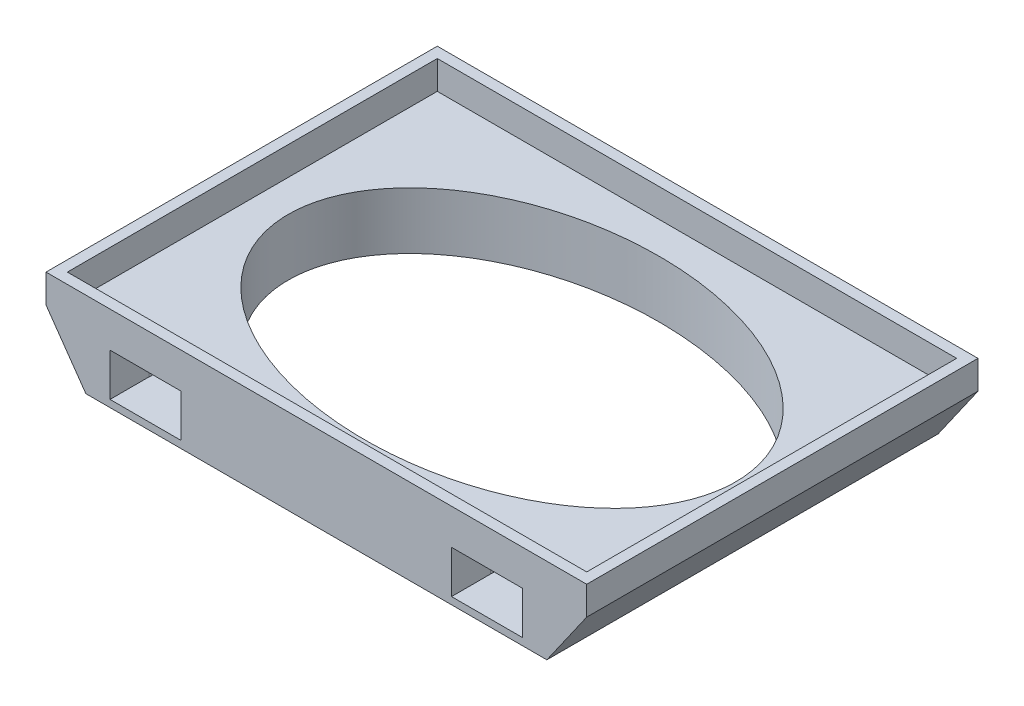
ISO-10303-21;
HEADER;
FILE_DESCRIPTION(('STEP AP214'),'2;1');
FILE_NAME('part.step','',(''),(''),'','','');
FILE_SCHEMA(('AUTOMOTIVE_DESIGN { 1 0 10303 214 1 1 1 1 }'));
ENDSEC;
DATA;
#1=APPLICATION_CONTEXT('core data for automotive mechanical design processes');
#2=APPLICATION_PROTOCOL_DEFINITION('international standard','automotive_design',2000,#1);
#3=PRODUCT_CONTEXT('',#1,'mechanical');
#4=PRODUCT('Part','Part','',(#3));
#5=PRODUCT_RELATED_PRODUCT_CATEGORY('part','',(#4));
#6=PRODUCT_DEFINITION_FORMATION('','',#4);
#7=PRODUCT_DEFINITION_CONTEXT('part definition',#1,'design');
#8=PRODUCT_DEFINITION('design','',#6,#7);
#9=PRODUCT_DEFINITION_SHAPE('','',#8);
#10=(LENGTH_UNIT() NAMED_UNIT(*) SI_UNIT(.MILLI.,.METRE.));
#11=(NAMED_UNIT(*) PLANE_ANGLE_UNIT() SI_UNIT($,.RADIAN.));
#12=(NAMED_UNIT(*) SI_UNIT($,.STERADIAN.) SOLID_ANGLE_UNIT());
#13=UNCERTAINTY_MEASURE_WITH_UNIT(LENGTH_MEASURE(1.E-05),#10,'distance_accuracy_value','');
#14=(GEOMETRIC_REPRESENTATION_CONTEXT(3) GLOBAL_UNCERTAINTY_ASSIGNED_CONTEXT((#13)) GLOBAL_UNIT_ASSIGNED_CONTEXT((#10,
#11,#12)) REPRESENTATION_CONTEXT('',''));
#15=CARTESIAN_POINT('',(0.,0.,0.));
#16=DIRECTION('',(0.,0.,1.));
#17=DIRECTION('',(1.,0.,0.));
#18=AXIS2_PLACEMENT_3D('',#15,#16,#17);
#19=CARTESIAN_POINT('',(-19.,-6.,-13.75));
#20=DIRECTION('',(0.,0.,-1.));
#21=DIRECTION('',(-1.,0.,0.));
#22=AXIS2_PLACEMENT_3D('',#19,#20,#21);
#23=PLANE('',#22);
#24=DIRECTION('',(-0.573576436351042,0.819152044288995,0.));
#25=VECTOR('',#24,1.);
#26=CARTESIAN_POINT('',(-19.,-2.,-13.75));
#27=LINE('',#26,#25);
#28=CARTESIAN_POINT('',(-16.1991698471612,-6.,-13.75));
#29=VERTEX_POINT('',#28);
#30=CARTESIAN_POINT('',(-19.,-2.,-13.75));
#31=VERTEX_POINT('',#30);
#32=EDGE_CURVE('E55',#29,#31,#27,.T.);
#33=ORIENTED_EDGE('',*,*,#32,.T.);
#34=DIRECTION('',(0.,1.,0.));
#35=VECTOR('',#34,1.);
#36=CARTESIAN_POINT('',(-19.,-6.,-13.75));
#37=LINE('',#36,#35);
#38=CARTESIAN_POINT('',(-19.,0.,-13.75));
#39=VERTEX_POINT('',#38);
#40=EDGE_CURVE('E245',#31,#39,#37,.T.);
#41=ORIENTED_EDGE('',*,*,#40,.T.);
#42=DIRECTION('',(-1.,0.,0.));
#43=VECTOR('',#42,1.);
#44=CARTESIAN_POINT('',(-19.,0.,-13.75));
#45=LINE('',#44,#43);
#46=CARTESIAN_POINT('',(19.,0.,-13.75));
#47=VERTEX_POINT('',#46);
#48=EDGE_CURVE('E226',#47,#39,#45,.T.);
#49=ORIENTED_EDGE('',*,*,#48,.F.);
#50=DIRECTION('',(0.,1.,0.));
#51=VECTOR('',#50,1.);
#52=CARTESIAN_POINT('',(19.,-6.,-13.75));
#53=LINE('',#52,#51);
#54=CARTESIAN_POINT('',(19.,-2.,-13.75));
#55=VERTEX_POINT('',#54);
#56=EDGE_CURVE('E248',#55,#47,#53,.T.);
#57=ORIENTED_EDGE('',*,*,#56,.F.);
#58=DIRECTION('',(-0.573576436351042,-0.819152044288994,0.));
#59=VECTOR('',#58,1.);
#60=CARTESIAN_POINT('',(19.,-2.,-13.75));
#61=LINE('',#60,#59);
#62=CARTESIAN_POINT('',(16.1991698471612,-6.,-13.75));
#63=VERTEX_POINT('',#62);
#64=EDGE_CURVE('E448',#55,#63,#61,.T.);
#65=ORIENTED_EDGE('',*,*,#64,.T.);
#66=DIRECTION('',(-1.,0.,0.));
#67=VECTOR('',#66,1.);
#68=CARTESIAN_POINT('',(-19.,-6.,-13.75));
#69=LINE('',#68,#67);
#70=EDGE_CURVE('E225',#63,#29,#69,.T.);
#71=ORIENTED_EDGE('',*,*,#70,.T.);
#72=EDGE_LOOP('',(#33,#41,#49,#57,#65,#71));
#73=FACE_BOUND('',#72,.T.);
#74=DIRECTION('',(1.,0.,0.));
#75=VECTOR('',#74,1.);
#76=CARTESIAN_POINT('',(-19.,-2.5,-13.75));
#77=LINE('',#76,#75);
#78=CARTESIAN_POINT('',(-14.5,-2.5,-13.75));
#79=VERTEX_POINT('',#78);
#80=CARTESIAN_POINT('',(-9.5,-2.5,-13.75));
#81=VERTEX_POINT('',#80);
#82=EDGE_CURVE('E11',#79,#81,#77,.T.);
#83=ORIENTED_EDGE('',*,*,#82,.F.);
#84=DIRECTION('',(0.,1.,0.));
#85=VECTOR('',#84,1.);
#86=CARTESIAN_POINT('',(-14.5,-6.,-13.75));
#87=LINE('',#86,#85);
#88=CARTESIAN_POINT('',(-14.5,-5.5,-13.75));
#89=VERTEX_POINT('',#88);
#90=EDGE_CURVE('E290',#89,#79,#87,.T.);
#91=ORIENTED_EDGE('',*,*,#90,.F.);
#92=DIRECTION('',(1.,0.,0.));
#93=VECTOR('',#92,1.);
#94=CARTESIAN_POINT('',(-19.,-5.5,-13.75));
#95=LINE('',#94,#93);
#96=CARTESIAN_POINT('',(-9.49999999999996,-5.5,-13.75));
#97=VERTEX_POINT('',#96);
#98=EDGE_CURVE('E287',#89,#97,#95,.T.);
#99=ORIENTED_EDGE('',*,*,#98,.T.);
#100=DIRECTION('',(0.,-1.,0.));
#101=VECTOR('',#100,1.);
#102=CARTESIAN_POINT('',(-9.5,-6.,-13.75));
#103=LINE('',#102,#101);
#104=EDGE_CURVE('E40',#81,#97,#103,.T.);
#105=ORIENTED_EDGE('',*,*,#104,.F.);
#106=EDGE_LOOP('',(#83,#91,#99,#105));
#107=FACE_BOUND('',#106,.T.);
#108=DIRECTION('',(0.,-1.,0.));
#109=VECTOR('',#108,1.);
#110=CARTESIAN_POINT('',(14.5,-6.,-13.75));
#111=LINE('',#110,#109);
#112=CARTESIAN_POINT('',(14.5,-2.5,-13.75));
#113=VERTEX_POINT('',#112);
#114=CARTESIAN_POINT('',(14.5,-5.5,-13.75));
#115=VERTEX_POINT('',#114);
#116=EDGE_CURVE('E281',#113,#115,#111,.T.);
#117=ORIENTED_EDGE('',*,*,#116,.F.);
#118=DIRECTION('',(-1.,0.,0.));
#119=VECTOR('',#118,1.);
#120=CARTESIAN_POINT('',(-19.,-2.5,-13.75));
#121=LINE('',#120,#119);
#122=CARTESIAN_POINT('',(9.49999999999999,-2.5,-13.75));
#123=VERTEX_POINT('',#122);
#124=EDGE_CURVE('E284',#113,#123,#121,.T.);
#125=ORIENTED_EDGE('',*,*,#124,.T.);
#126=DIRECTION('',(0.,1.,0.));
#127=VECTOR('',#126,1.);
#128=CARTESIAN_POINT('',(9.49999999999999,-6.,-13.75));
#129=LINE('',#128,#127);
#130=CARTESIAN_POINT('',(9.49999999999999,-5.5,-13.75));
#131=VERTEX_POINT('',#130);
#132=EDGE_CURVE('E279',#131,#123,#129,.T.);
#133=ORIENTED_EDGE('',*,*,#132,.F.);
#134=DIRECTION('',(-1.,0.,0.));
#135=VECTOR('',#134,1.);
#136=CARTESIAN_POINT('',(-19.,-5.5,-13.75));
#137=LINE('',#136,#135);
#138=EDGE_CURVE('E277',#115,#131,#137,.T.);
#139=ORIENTED_EDGE('',*,*,#138,.F.);
#140=EDGE_LOOP('',(#117,#125,#133,#139));
#141=FACE_BOUND('',#140,.T.);
#142=ADVANCED_FACE('F32',(#73,#107,#141),#23,.T.);
#143=CARTESIAN_POINT('',(-19.,-6.,13.75));
#144=DIRECTION('',(0.,0.,1.));
#145=DIRECTION('',(1.,0.,0.));
#146=AXIS2_PLACEMENT_3D('',#143,#144,#145);
#147=PLANE('',#146);
#148=DIRECTION('',(-0.573576436351042,0.819152044288995,0.));
#149=VECTOR('',#148,1.);
#150=CARTESIAN_POINT('',(-19.,-2.,13.75));
#151=LINE('',#150,#149);
#152=CARTESIAN_POINT('',(-16.1991698471612,-6.,13.75));
#153=VERTEX_POINT('',#152);
#154=CARTESIAN_POINT('',(-19.,-2.,13.75));
#155=VERTEX_POINT('',#154);
#156=EDGE_CURVE('E204',#153,#155,#151,.T.);
#157=ORIENTED_EDGE('',*,*,#156,.F.);
#158=DIRECTION('',(1.,0.,0.));
#159=VECTOR('',#158,1.);
#160=CARTESIAN_POINT('',(-19.,-6.,13.75));
#161=LINE('',#160,#159);
#162=CARTESIAN_POINT('',(16.1991698471612,-6.,13.75));
#163=VERTEX_POINT('',#162);
#164=EDGE_CURVE('E217',#153,#163,#161,.T.);
#165=ORIENTED_EDGE('',*,*,#164,.T.);
#166=DIRECTION('',(-0.573576436351042,-0.819152044288994,0.));
#167=VECTOR('',#166,1.);
#168=CARTESIAN_POINT('',(19.,-2.,13.75));
#169=LINE('',#168,#167);
#170=CARTESIAN_POINT('',(19.,-2.,13.75));
#171=VERTEX_POINT('',#170);
#172=EDGE_CURVE('E47',#171,#163,#169,.T.);
#173=ORIENTED_EDGE('',*,*,#172,.F.);
#174=DIRECTION('',(0.,1.,0.));
#175=VECTOR('',#174,1.);
#176=CARTESIAN_POINT('',(19.,-6.,13.75));
#177=LINE('',#176,#175);
#178=CARTESIAN_POINT('',(19.,0.,13.75));
#179=VERTEX_POINT('',#178);
#180=EDGE_CURVE('E250',#171,#179,#177,.T.);
#181=ORIENTED_EDGE('',*,*,#180,.T.);
#182=DIRECTION('',(1.,0.,0.));
#183=VECTOR('',#182,1.);
#184=CARTESIAN_POINT('',(-19.,0.,13.75));
#185=LINE('',#184,#183);
#186=CARTESIAN_POINT('',(-19.,0.,13.75));
#187=VERTEX_POINT('',#186);
#188=EDGE_CURVE('E239',#187,#179,#185,.T.);
#189=ORIENTED_EDGE('',*,*,#188,.F.);
#190=DIRECTION('',(0.,1.,0.));
#191=VECTOR('',#190,1.);
#192=CARTESIAN_POINT('',(-19.,-6.,13.75));
#193=LINE('',#192,#191);
#194=EDGE_CURVE('E219',#155,#187,#193,.T.);
#195=ORIENTED_EDGE('',*,*,#194,.F.);
#196=EDGE_LOOP('',(#157,#165,#173,#181,#189,#195));
#197=FACE_BOUND('',#196,.T.);
#198=DIRECTION('',(-1.,0.,0.));
#199=VECTOR('',#198,1.);
#200=CARTESIAN_POINT('',(-19.,-2.5,13.75));
#201=LINE('',#200,#199);
#202=CARTESIAN_POINT('',(14.5,-2.5,13.75));
#203=VERTEX_POINT('',#202);
#204=CARTESIAN_POINT('',(9.49999999999999,-2.5,13.75));
#205=VERTEX_POINT('',#204);
#206=EDGE_CURVE('E275',#203,#205,#201,.T.);
#207=ORIENTED_EDGE('',*,*,#206,.F.);
#208=DIRECTION('',(0.,1.,0.));
#209=VECTOR('',#208,1.);
#210=CARTESIAN_POINT('',(14.5,-6.,13.75));
#211=LINE('',#210,#209);
#212=CARTESIAN_POINT('',(14.5,-5.5,13.75));
#213=VERTEX_POINT('',#212);
#214=EDGE_CURVE('E270',#213,#203,#211,.T.);
#215=ORIENTED_EDGE('',*,*,#214,.F.);
#216=DIRECTION('',(-1.,0.,0.));
#217=VECTOR('',#216,1.);
#218=CARTESIAN_POINT('',(-19.,-5.5,13.75));
#219=LINE('',#218,#217);
#220=CARTESIAN_POINT('',(9.49999999999995,-5.5,13.75));
#221=VERTEX_POINT('',#220);
#222=EDGE_CURVE('E267',#213,#221,#219,.T.);
#223=ORIENTED_EDGE('',*,*,#222,.T.);
#224=DIRECTION('',(0.,-1.,0.));
#225=VECTOR('',#224,1.);
#226=CARTESIAN_POINT('',(9.49999999999999,-6.,13.75));
#227=LINE('',#226,#225);
#228=EDGE_CURVE('E272',#205,#221,#227,.T.);
#229=ORIENTED_EDGE('',*,*,#228,.F.);
#230=EDGE_LOOP('',(#207,#215,#223,#229));
#231=FACE_BOUND('',#230,.T.);
#232=DIRECTION('',(0.,-1.,0.));
#233=VECTOR('',#232,1.);
#234=CARTESIAN_POINT('',(-14.5,-6.,13.75));
#235=LINE('',#234,#233);
#236=CARTESIAN_POINT('',(-14.5,-2.5,13.75));
#237=VERTEX_POINT('',#236);
#238=CARTESIAN_POINT('',(-14.5,-5.5,13.75));
#239=VERTEX_POINT('',#238);
#240=EDGE_CURVE('E261',#237,#239,#235,.T.);
#241=ORIENTED_EDGE('',*,*,#240,.F.);
#242=DIRECTION('',(1.,0.,0.));
#243=VECTOR('',#242,1.);
#244=CARTESIAN_POINT('',(-19.,-2.5,13.75));
#245=LINE('',#244,#243);
#246=CARTESIAN_POINT('',(-9.5,-2.5,13.75));
#247=VERTEX_POINT('',#246);
#248=EDGE_CURVE('E264',#237,#247,#245,.T.);
#249=ORIENTED_EDGE('',*,*,#248,.T.);
#250=DIRECTION('',(0.,1.,0.));
#251=VECTOR('',#250,1.);
#252=CARTESIAN_POINT('',(-9.5,-6.,13.75));
#253=LINE('',#252,#251);
#254=CARTESIAN_POINT('',(-9.5,-5.5,13.75));
#255=VERTEX_POINT('',#254);
#256=EDGE_CURVE('E259',#255,#247,#253,.T.);
#257=ORIENTED_EDGE('',*,*,#256,.F.);
#258=DIRECTION('',(1.,0.,0.));
#259=VECTOR('',#258,1.);
#260=CARTESIAN_POINT('',(-19.,-5.5,13.75));
#261=LINE('',#260,#259);
#262=EDGE_CURVE('E247',#239,#255,#261,.T.);
#263=ORIENTED_EDGE('',*,*,#262,.F.);
#264=EDGE_LOOP('',(#241,#249,#257,#263));
#265=FACE_BOUND('',#264,.T.);
#266=ADVANCED_FACE('F215',(#197,#231,#265),#147,.T.);
#267=CARTESIAN_POINT('',(-19.,-6.,13.75));
#268=DIRECTION('',(-1.,0.,0.));
#269=DIRECTION('',(0.,0.,1.));
#270=AXIS2_PLACEMENT_3D('',#267,#268,#269);
#271=PLANE('',#270);
#272=DIRECTION('',(0.,0.,1.));
#273=VECTOR('',#272,1.);
#274=CARTESIAN_POINT('',(-19.,-2.,-13.75));
#275=LINE('',#274,#273);
#276=EDGE_CURVE('E210',#31,#155,#275,.T.);
#277=ORIENTED_EDGE('',*,*,#276,.T.);
#278=ORIENTED_EDGE('',*,*,#194,.T.);
#279=DIRECTION('',(0.,0.,1.));
#280=VECTOR('',#279,1.);
#281=CARTESIAN_POINT('',(-19.,0.,13.75));
#282=LINE('',#281,#280);
#283=EDGE_CURVE('E236',#39,#187,#282,.T.);
#284=ORIENTED_EDGE('',*,*,#283,.F.);
#285=ORIENTED_EDGE('',*,*,#40,.F.);
#286=EDGE_LOOP('',(#277,#278,#284,#285));
#287=FACE_BOUND('',#286,.T.);
#288=ADVANCED_FACE('F34',(#287),#271,.T.);
#289=CARTESIAN_POINT('',(19.,-6.,13.75));
#290=DIRECTION('',(1.,0.,0.));
#291=DIRECTION('',(0.,0.,-1.));
#292=AXIS2_PLACEMENT_3D('',#289,#290,#291);
#293=PLANE('',#292);
#294=DIRECTION('',(0.,0.,1.));
#295=VECTOR('',#294,1.);
#296=CARTESIAN_POINT('',(19.,-2.,-13.75));
#297=LINE('',#296,#295);
#298=EDGE_CURVE('E220',#55,#171,#297,.T.);
#299=ORIENTED_EDGE('',*,*,#298,.F.);
#300=ORIENTED_EDGE('',*,*,#56,.T.);
#301=DIRECTION('',(0.,0.,-1.));
#302=VECTOR('',#301,1.);
#303=CARTESIAN_POINT('',(19.,0.,13.75));
#304=LINE('',#303,#302);
#305=EDGE_CURVE('E230',#179,#47,#304,.T.);
#306=ORIENTED_EDGE('',*,*,#305,.F.);
#307=ORIENTED_EDGE('',*,*,#180,.F.);
#308=EDGE_LOOP('',(#299,#300,#306,#307));
#309=FACE_BOUND('',#308,.T.);
#310=ADVANCED_FACE('F426',(#309),#293,.T.);
#311=CARTESIAN_POINT('',(0.,-6.,0.));
#312=DIRECTION('',(0.,-1.,0.));
#313=DIRECTION('',(0.,0.,-1.));
#314=AXIS2_PLACEMENT_3D('',#311,#312,#313);
#315=PLANE('',#314);
#316=DIRECTION('',(0.,0.,1.));
#317=VECTOR('',#316,1.);
#318=CARTESIAN_POINT('',(-16.1991698471612,-6.,-13.75));
#319=LINE('',#318,#317);
#320=EDGE_CURVE('E201',#29,#153,#319,.T.);
#321=ORIENTED_EDGE('',*,*,#320,.F.);
#322=ORIENTED_EDGE('',*,*,#70,.F.);
#323=DIRECTION('',(0.,0.,1.));
#324=VECTOR('',#323,1.);
#325=CARTESIAN_POINT('',(16.1991698471612,-6.,-13.75));
#326=LINE('',#325,#324);
#327=EDGE_CURVE('E224',#63,#163,#326,.T.);
#328=ORIENTED_EDGE('',*,*,#327,.T.);
#329=ORIENTED_EDGE('',*,*,#164,.F.);
#330=EDGE_LOOP('',(#321,#322,#328,#329));
#331=FACE_BOUND('',#330,.T.);
#332=CARTESIAN_POINT('',(0.,-6.,0.));
#333=DIRECTION('',(0.,1.,0.));
#334=DIRECTION('',(0.999515945982097,0.,0.0311106690303014));
#335=AXIS2_PLACEMENT_3D('',#332,#333,#334);
#336=ELLIPSE('',#335,16.0077486150347,10.7552061007264);
#337=CARTESIAN_POINT('',(16.,-6.,0.49801176908261));
#338=VERTEX_POINT('',#337);
#339=EDGE_CURVE('E257',#338,#338,#336,.T.);
#340=ORIENTED_EDGE('',*,*,#339,.T.);
#341=EDGE_LOOP('',(#340));
#342=FACE_BOUND('',#341,.T.);
#343=ADVANCED_FACE('F222',(#331,#342),#315,.T.);
#344=CARTESIAN_POINT('',(0.,0.,0.));
#345=DIRECTION('',(0.,-1.,0.));
#346=DIRECTION('',(0.,0.,-1.));
#347=AXIS2_PLACEMENT_3D('',#344,#345,#346);
#348=PLANE('',#347);
#349=DIRECTION('',(1.,0.,0.));
#350=VECTOR('',#349,1.);
#351=CARTESIAN_POINT('',(-18.25,0.,13.));
#352=LINE('',#351,#350);
#353=CARTESIAN_POINT('',(-18.25,0.,13.));
#354=VERTEX_POINT('',#353);
#355=CARTESIAN_POINT('',(18.25,0.,13.));
#356=VERTEX_POINT('',#355);
#357=EDGE_CURVE('E770',#354,#356,#352,.T.);
#358=ORIENTED_EDGE('',*,*,#357,.F.);
#359=DIRECTION('',(0.,0.,1.));
#360=VECTOR('',#359,1.);
#361=CARTESIAN_POINT('',(-18.25,0.,-13.));
#362=LINE('',#361,#360);
#363=CARTESIAN_POINT('',(-18.25,0.,-13.));
#364=VERTEX_POINT('',#363);
#365=EDGE_CURVE('E256',#364,#354,#362,.T.);
#366=ORIENTED_EDGE('',*,*,#365,.F.);
#367=DIRECTION('',(-1.,0.,0.));
#368=VECTOR('',#367,1.);
#369=CARTESIAN_POINT('',(-18.25,0.,-13.));
#370=LINE('',#369,#368);
#371=CARTESIAN_POINT('',(18.25,0.,-13.));
#372=VERTEX_POINT('',#371);
#373=EDGE_CURVE('E776',#372,#364,#370,.T.);
#374=ORIENTED_EDGE('',*,*,#373,.F.);
#375=DIRECTION('',(0.,0.,-1.));
#376=VECTOR('',#375,1.);
#377=CARTESIAN_POINT('',(18.25,0.,-13.));
#378=LINE('',#377,#376);
#379=EDGE_CURVE('E773',#356,#372,#378,.T.);
#380=ORIENTED_EDGE('',*,*,#379,.F.);
#381=EDGE_LOOP('',(#358,#366,#374,#380));
#382=FACE_BOUND('',#381,.T.);
#383=ORIENTED_EDGE('',*,*,#283,.T.);
#384=ORIENTED_EDGE('',*,*,#188,.T.);
#385=ORIENTED_EDGE('',*,*,#305,.T.);
#386=ORIENTED_EDGE('',*,*,#48,.T.);
#387=EDGE_LOOP('',(#383,#384,#385,#386));
#388=FACE_BOUND('',#387,.T.);
#389=ADVANCED_FACE('F422',(#382,#388),#348,.F.);
#390=CARTESIAN_POINT('',(-18.25,-2.,-13.));
#391=DIRECTION('',(-1.,0.,0.));
#392=DIRECTION('',(0.,0.,1.));
#393=AXIS2_PLACEMENT_3D('',#390,#391,#392);
#394=PLANE('',#393);
#395=ORIENTED_EDGE('',*,*,#365,.T.);
#396=DIRECTION('',(0.,1.,0.));
#397=VECTOR('',#396,1.);
#398=CARTESIAN_POINT('',(-18.25,-2.,13.));
#399=LINE('',#398,#397);
#400=CARTESIAN_POINT('',(-18.25,-2.,13.));
#401=VERTEX_POINT('',#400);
#402=EDGE_CURVE('E233',#401,#354,#399,.T.);
#403=ORIENTED_EDGE('',*,*,#402,.F.);
#404=DIRECTION('',(0.,0.,1.));
#405=VECTOR('',#404,1.);
#406=CARTESIAN_POINT('',(-18.25,-2.,-13.));
#407=LINE('',#406,#405);
#408=CARTESIAN_POINT('',(-18.25,-2.,-13.));
#409=VERTEX_POINT('',#408);
#410=EDGE_CURVE('E392',#409,#401,#407,.T.);
#411=ORIENTED_EDGE('',*,*,#410,.F.);
#412=DIRECTION('',(0.,1.,0.));
#413=VECTOR('',#412,1.);
#414=CARTESIAN_POINT('',(-18.25,-2.,-13.));
#415=LINE('',#414,#413);
#416=EDGE_CURVE('E240',#409,#364,#415,.T.);
#417=ORIENTED_EDGE('',*,*,#416,.T.);
#418=EDGE_LOOP('',(#395,#403,#411,#417));
#419=FACE_BOUND('',#418,.T.);
#420=ADVANCED_FACE('F412',(#419),#394,.F.);
#421=CARTESIAN_POINT('',(-18.25,-2.,-13.));
#422=DIRECTION('',(0.,0.,-1.));
#423=DIRECTION('',(-1.,0.,0.));
#424=AXIS2_PLACEMENT_3D('',#421,#422,#423);
#425=PLANE('',#424);
#426=ORIENTED_EDGE('',*,*,#373,.T.);
#427=ORIENTED_EDGE('',*,*,#416,.F.);
#428=DIRECTION('',(-1.,0.,0.));
#429=VECTOR('',#428,1.);
#430=CARTESIAN_POINT('',(-18.25,-2.,-13.));
#431=LINE('',#430,#429);
#432=CARTESIAN_POINT('',(18.25,-2.,-13.));
#433=VERTEX_POINT('',#432);
#434=EDGE_CURVE('E787',#433,#409,#431,.T.);
#435=ORIENTED_EDGE('',*,*,#434,.F.);
#436=DIRECTION('',(0.,1.,0.));
#437=VECTOR('',#436,1.);
#438=CARTESIAN_POINT('',(18.25,-2.,-13.));
#439=LINE('',#438,#437);
#440=EDGE_CURVE('E784',#433,#372,#439,.T.);
#441=ORIENTED_EDGE('',*,*,#440,.T.);
#442=EDGE_LOOP('',(#426,#427,#435,#441));
#443=FACE_BOUND('',#442,.T.);
#444=ADVANCED_FACE('F408',(#443),#425,.F.);
#445=CARTESIAN_POINT('',(18.25,-2.,-13.));
#446=DIRECTION('',(1.,0.,0.));
#447=DIRECTION('',(0.,0.,-1.));
#448=AXIS2_PLACEMENT_3D('',#445,#446,#447);
#449=PLANE('',#448);
#450=ORIENTED_EDGE('',*,*,#379,.T.);
#451=ORIENTED_EDGE('',*,*,#440,.F.);
#452=DIRECTION('',(0.,0.,-1.));
#453=VECTOR('',#452,1.);
#454=CARTESIAN_POINT('',(18.25,-2.,-13.));
#455=LINE('',#454,#453);
#456=CARTESIAN_POINT('',(18.25,-2.,13.));
#457=VERTEX_POINT('',#456);
#458=EDGE_CURVE('E790',#457,#433,#455,.T.);
#459=ORIENTED_EDGE('',*,*,#458,.F.);
#460=DIRECTION('',(0.,1.,0.));
#461=VECTOR('',#460,1.);
#462=CARTESIAN_POINT('',(18.25,-2.,13.));
#463=LINE('',#462,#461);
#464=EDGE_CURVE('E785',#457,#356,#463,.T.);
#465=ORIENTED_EDGE('',*,*,#464,.T.);
#466=EDGE_LOOP('',(#450,#451,#459,#465));
#467=FACE_BOUND('',#466,.T.);
#468=ADVANCED_FACE('F411',(#467),#449,.F.);
#469=CARTESIAN_POINT('',(-18.25,-2.,13.));
#470=DIRECTION('',(0.,0.,1.));
#471=DIRECTION('',(1.,0.,0.));
#472=AXIS2_PLACEMENT_3D('',#469,#470,#471);
#473=PLANE('',#472);
#474=ORIENTED_EDGE('',*,*,#357,.T.);
#475=ORIENTED_EDGE('',*,*,#464,.F.);
#476=DIRECTION('',(1.,0.,0.));
#477=VECTOR('',#476,1.);
#478=CARTESIAN_POINT('',(-18.25,-2.,13.));
#479=LINE('',#478,#477);
#480=EDGE_CURVE('E795',#401,#457,#479,.T.);
#481=ORIENTED_EDGE('',*,*,#480,.F.);
#482=ORIENTED_EDGE('',*,*,#402,.T.);
#483=EDGE_LOOP('',(#474,#475,#481,#482));
#484=FACE_BOUND('',#483,.T.);
#485=ADVANCED_FACE('F406',(#484),#473,.F.);
#486=CARTESIAN_POINT('',(0.,-2.,0.));
#487=DIRECTION('',(0.,1.,0.));
#488=DIRECTION('',(0.,0.,1.));
#489=AXIS2_PLACEMENT_3D('',#486,#487,#488);
#490=PLANE('',#489);
#491=CARTESIAN_POINT('',(0.,-2.,0.));
#492=DIRECTION('',(0.,1.,0.));
#493=DIRECTION('',(0.999515945982097,0.,0.0311106690303014));
#494=AXIS2_PLACEMENT_3D('',#491,#492,#493);
#495=ELLIPSE('',#494,16.0077486150347,10.7552061007264);
#496=CARTESIAN_POINT('',(16.,-2.,0.49801176908261));
#497=VERTEX_POINT('',#496);
#498=EDGE_CURVE('E253',#497,#497,#495,.T.);
#499=ORIENTED_EDGE('',*,*,#498,.F.);
#500=EDGE_LOOP('',(#499));
#501=FACE_BOUND('',#500,.T.);
#502=ORIENTED_EDGE('',*,*,#410,.T.);
#503=ORIENTED_EDGE('',*,*,#480,.T.);
#504=ORIENTED_EDGE('',*,*,#458,.T.);
#505=ORIENTED_EDGE('',*,*,#434,.T.);
#506=EDGE_LOOP('',(#502,#503,#504,#505));
#507=FACE_BOUND('',#506,.T.);
#508=ADVANCED_FACE('F400',(#501,#507),#490,.T.);
#509=DIRECTION('',(0.,1.,0.));
#510=VECTOR('',#509,1.);
#511=SURFACE_OF_LINEAR_EXTRUSION('',#336,#510);
#512=ORIENTED_EDGE('',*,*,#498,.T.);
#513=EDGE_LOOP('',(#512));
#514=FACE_BOUND('',#513,.T.);
#515=ORIENTED_EDGE('',*,*,#339,.F.);
#516=EDGE_LOOP('',(#515));
#517=FACE_BOUND('',#516,.T.);
#518=ADVANCED_FACE('F395',(#514,#517),#511,.F.);
#519=CARTESIAN_POINT('',(-12.,-2.5,11.));
#520=DIRECTION('',(0.,-1.,0.));
#521=DIRECTION('',(0.,0.,-1.));
#522=AXIS2_PLACEMENT_3D('',#519,#520,#521);
#523=CYLINDRICAL_SURFACE('',#522,2.5);
#524=CARTESIAN_POINT('',(-12.,-5.5,11.));
#525=DIRECTION('',(0.,-1.,0.));
#526=DIRECTION('',(0.,0.,-1.));
#527=AXIS2_PLACEMENT_3D('',#524,#525,#526);
#528=CIRCLE('',#527,2.5);
#529=CARTESIAN_POINT('',(-14.5,-5.5,11.));
#530=VERTEX_POINT('',#529);
#531=CARTESIAN_POINT('',(-9.50000000000001,-5.5,11.));
#532=VERTEX_POINT('',#531);
#533=EDGE_CURVE('E338',#530,#532,#528,.T.);
#534=ORIENTED_EDGE('',*,*,#533,.T.);
#535=DIRECTION('',(0.,-1.,0.));
#536=VECTOR('',#535,1.);
#537=CARTESIAN_POINT('',(-9.50000000000001,-2.5,11.));
#538=LINE('',#537,#536);
#539=CARTESIAN_POINT('',(-9.50000000000001,-2.5,11.));
#540=VERTEX_POINT('',#539);
#541=EDGE_CURVE('E337',#540,#532,#538,.T.);
#542=ORIENTED_EDGE('',*,*,#541,.F.);
#543=CARTESIAN_POINT('',(-12.,-2.5,11.));
#544=DIRECTION('',(0.,-1.,0.));
#545=DIRECTION('',(0.,0.,-1.));
#546=AXIS2_PLACEMENT_3D('',#543,#544,#545);
#547=CIRCLE('',#546,2.5);
#548=CARTESIAN_POINT('',(-14.5,-2.5,11.));
#549=VERTEX_POINT('',#548);
#550=EDGE_CURVE('E328',#549,#540,#547,.T.);
#551=ORIENTED_EDGE('',*,*,#550,.F.);
#552=DIRECTION('',(0.,-1.,0.));
#553=VECTOR('',#552,1.);
#554=CARTESIAN_POINT('',(-14.5,-2.5,11.));
#555=LINE('',#554,#553);
#556=EDGE_CURVE('E320',#549,#530,#555,.T.);
#557=ORIENTED_EDGE('',*,*,#556,.T.);
#558=EDGE_LOOP('',(#534,#542,#551,#557));
#559=FACE_BOUND('',#558,.T.);
#560=ADVANCED_FACE('F399',(#559),#523,.F.);
#561=CARTESIAN_POINT('',(-14.5,-2.5,11.));
#562=DIRECTION('',(-1.,0.,0.));
#563=DIRECTION('',(0.,0.,1.));
#564=AXIS2_PLACEMENT_3D('',#561,#562,#563);
#565=PLANE('',#564);
#566=ORIENTED_EDGE('',*,*,#240,.T.);
#567=DIRECTION('',(0.,0.,-1.));
#568=VECTOR('',#567,1.);
#569=CARTESIAN_POINT('',(-14.5,-5.5,11.));
#570=LINE('',#569,#568);
#571=EDGE_CURVE('E332',#239,#530,#570,.T.);
#572=ORIENTED_EDGE('',*,*,#571,.T.);
#573=ORIENTED_EDGE('',*,*,#556,.F.);
#574=DIRECTION('',(0.,0.,-1.));
#575=VECTOR('',#574,1.);
#576=CARTESIAN_POINT('',(-14.5,-2.5,11.));
#577=LINE('',#576,#575);
#578=EDGE_CURVE('E335',#237,#549,#577,.T.);
#579=ORIENTED_EDGE('',*,*,#578,.F.);
#580=EDGE_LOOP('',(#566,#572,#573,#579));
#581=FACE_BOUND('',#580,.T.);
#582=ADVANCED_FACE('F484',(#581),#565,.F.);
#583=CARTESIAN_POINT('',(-9.49999999999996,-2.5,23.5626620578931));
#584=DIRECTION('',(1.,0.,0.));
#585=DIRECTION('',(0.,0.,-1.));
#586=AXIS2_PLACEMENT_3D('',#583,#584,#585);
#587=PLANE('',#586);
#588=ORIENTED_EDGE('',*,*,#256,.T.);
#589=DIRECTION('',(0.,0.,1.));
#590=VECTOR('',#589,1.);
#591=CARTESIAN_POINT('',(-9.49999999999996,-2.5,23.5626620578931));
#592=LINE('',#591,#590);
#593=EDGE_CURVE('E331',#540,#247,#592,.T.);
#594=ORIENTED_EDGE('',*,*,#593,.F.);
#595=ORIENTED_EDGE('',*,*,#541,.T.);
#596=DIRECTION('',(0.,0.,1.));
#597=VECTOR('',#596,1.);
#598=CARTESIAN_POINT('',(-9.49999999999996,-5.5,23.5626620578931));
#599=LINE('',#598,#597);
#600=EDGE_CURVE('E341',#532,#255,#599,.T.);
#601=ORIENTED_EDGE('',*,*,#600,.T.);
#602=EDGE_LOOP('',(#588,#594,#595,#601));
#603=FACE_BOUND('',#602,.T.);
#604=ADVANCED_FACE('F478',(#603),#587,.F.);
#605=CARTESIAN_POINT('',(-12.,-2.5,11.));
#606=DIRECTION('',(0.,-1.,0.));
#607=DIRECTION('',(0.,0.,-1.));
#608=AXIS2_PLACEMENT_3D('',#605,#606,#607);
#609=PLANE('',#608);
#610=ORIENTED_EDGE('',*,*,#578,.T.);
#611=ORIENTED_EDGE('',*,*,#550,.T.);
#612=ORIENTED_EDGE('',*,*,#593,.T.);
#613=ORIENTED_EDGE('',*,*,#248,.F.);
#614=EDGE_LOOP('',(#610,#611,#612,#613));
#615=FACE_BOUND('',#614,.T.);
#616=ADVANCED_FACE('F474',(#615),#609,.T.);
#617=CARTESIAN_POINT('',(-12.,-5.5,11.));
#618=DIRECTION('',(0.,-1.,0.));
#619=DIRECTION('',(0.,0.,-1.));
#620=AXIS2_PLACEMENT_3D('',#617,#618,#619);
#621=PLANE('',#620);
#622=ORIENTED_EDGE('',*,*,#262,.T.);
#623=ORIENTED_EDGE('',*,*,#600,.F.);
#624=ORIENTED_EDGE('',*,*,#533,.F.);
#625=ORIENTED_EDGE('',*,*,#571,.F.);
#626=EDGE_LOOP('',(#622,#623,#624,#625));
#627=FACE_BOUND('',#626,.T.);
#628=ADVANCED_FACE('F477',(#627),#621,.F.);
#629=CARTESIAN_POINT('',(12.,-2.5,11.));
#630=DIRECTION('',(0.,-1.,0.));
#631=DIRECTION('',(0.,0.,-1.));
#632=AXIS2_PLACEMENT_3D('',#629,#630,#631);
#633=CYLINDRICAL_SURFACE('',#632,2.5);
#634=CARTESIAN_POINT('',(12.,-5.5,11.));
#635=DIRECTION('',(0.,-1.,0.));
#636=DIRECTION('',(0.,0.,1.));
#637=AXIS2_PLACEMENT_3D('',#634,#635,#636);
#638=CIRCLE('',#637,2.5);
#639=CARTESIAN_POINT('',(9.5,-5.5,11.));
#640=VERTEX_POINT('',#639);
#641=CARTESIAN_POINT('',(14.5,-5.5,11.));
#642=VERTEX_POINT('',#641);
#643=EDGE_CURVE('E359',#640,#642,#638,.T.);
#644=ORIENTED_EDGE('',*,*,#643,.T.);
#645=DIRECTION('',(0.,-1.,0.));
#646=VECTOR('',#645,1.);
#647=CARTESIAN_POINT('',(14.5,-2.5,11.));
#648=LINE('',#647,#646);
#649=CARTESIAN_POINT('',(14.5,-2.5,11.));
#650=VERTEX_POINT('',#649);
#651=EDGE_CURVE('E358',#650,#642,#648,.T.);
#652=ORIENTED_EDGE('',*,*,#651,.F.);
#653=CARTESIAN_POINT('',(12.,-2.5,11.));
#654=DIRECTION('',(0.,-1.,0.));
#655=DIRECTION('',(0.,0.,1.));
#656=AXIS2_PLACEMENT_3D('',#653,#654,#655);
#657=CIRCLE('',#656,2.5);
#658=CARTESIAN_POINT('',(9.5,-2.5,11.));
#659=VERTEX_POINT('',#658);
#660=EDGE_CURVE('E349',#659,#650,#657,.T.);
#661=ORIENTED_EDGE('',*,*,#660,.F.);
#662=DIRECTION('',(0.,-1.,0.));
#663=VECTOR('',#662,1.);
#664=CARTESIAN_POINT('',(9.5,-2.5,11.));
#665=LINE('',#664,#663);
#666=EDGE_CURVE('E342',#659,#640,#665,.T.);
#667=ORIENTED_EDGE('',*,*,#666,.T.);
#668=EDGE_LOOP('',(#644,#652,#661,#667));
#669=FACE_BOUND('',#668,.T.);
#670=ADVANCED_FACE('F482',(#669),#633,.F.);
#671=CARTESIAN_POINT('',(9.49999999999995,-2.5,23.5626620578931));
#672=DIRECTION('',(-1.,0.,0.));
#673=DIRECTION('',(0.,0.,1.));
#674=AXIS2_PLACEMENT_3D('',#671,#672,#673);
#675=PLANE('',#674);
#676=ORIENTED_EDGE('',*,*,#228,.T.);
#677=DIRECTION('',(0.,0.,-1.));
#678=VECTOR('',#677,1.);
#679=CARTESIAN_POINT('',(9.49999999999995,-5.5,23.5626620578931));
#680=LINE('',#679,#678);
#681=EDGE_CURVE('E353',#221,#640,#680,.T.);
#682=ORIENTED_EDGE('',*,*,#681,.T.);
#683=ORIENTED_EDGE('',*,*,#666,.F.);
#684=DIRECTION('',(0.,0.,-1.));
#685=VECTOR('',#684,1.);
#686=CARTESIAN_POINT('',(9.49999999999995,-2.5,23.5626620578931));
#687=LINE('',#686,#685);
#688=EDGE_CURVE('E356',#205,#659,#687,.T.);
#689=ORIENTED_EDGE('',*,*,#688,.F.);
#690=EDGE_LOOP('',(#676,#682,#683,#689));
#691=FACE_BOUND('',#690,.T.);
#692=ADVANCED_FACE('F503',(#691),#675,.F.);
#693=CARTESIAN_POINT('',(14.5,-2.5,11.));
#694=DIRECTION('',(1.,0.,0.));
#695=DIRECTION('',(0.,0.,-1.));
#696=AXIS2_PLACEMENT_3D('',#693,#694,#695);
#697=PLANE('',#696);
#698=ORIENTED_EDGE('',*,*,#214,.T.);
#699=DIRECTION('',(0.,0.,1.));
#700=VECTOR('',#699,1.);
#701=CARTESIAN_POINT('',(14.5,-2.5,11.));
#702=LINE('',#701,#700);
#703=EDGE_CURVE('E352',#650,#203,#702,.T.);
#704=ORIENTED_EDGE('',*,*,#703,.F.);
#705=ORIENTED_EDGE('',*,*,#651,.T.);
#706=DIRECTION('',(0.,0.,1.));
#707=VECTOR('',#706,1.);
#708=CARTESIAN_POINT('',(14.5,-5.5,11.));
#709=LINE('',#708,#707);
#710=EDGE_CURVE('E362',#642,#213,#709,.T.);
#711=ORIENTED_EDGE('',*,*,#710,.T.);
#712=EDGE_LOOP('',(#698,#704,#705,#711));
#713=FACE_BOUND('',#712,.T.);
#714=ADVANCED_FACE('F498',(#713),#697,.F.);
#715=CARTESIAN_POINT('',(12.,-2.5,11.));
#716=DIRECTION('',(0.,1.,0.));
#717=DIRECTION('',(0.,0.,1.));
#718=AXIS2_PLACEMENT_3D('',#715,#716,#717);
#719=PLANE('',#718);
#720=ORIENTED_EDGE('',*,*,#206,.T.);
#721=ORIENTED_EDGE('',*,*,#688,.T.);
#722=ORIENTED_EDGE('',*,*,#660,.T.);
#723=ORIENTED_EDGE('',*,*,#703,.T.);
#724=EDGE_LOOP('',(#720,#721,#722,#723));
#725=FACE_BOUND('',#724,.T.);
#726=ADVANCED_FACE('F494',(#725),#719,.F.);
#727=CARTESIAN_POINT('',(12.,-5.5,11.));
#728=DIRECTION('',(0.,1.,0.));
#729=DIRECTION('',(0.,0.,1.));
#730=AXIS2_PLACEMENT_3D('',#727,#728,#729);
#731=PLANE('',#730);
#732=ORIENTED_EDGE('',*,*,#710,.F.);
#733=ORIENTED_EDGE('',*,*,#643,.F.);
#734=ORIENTED_EDGE('',*,*,#681,.F.);
#735=ORIENTED_EDGE('',*,*,#222,.F.);
#736=EDGE_LOOP('',(#732,#733,#734,#735));
#737=FACE_BOUND('',#736,.T.);
#738=ADVANCED_FACE('F497',(#737),#731,.T.);
#739=CARTESIAN_POINT('',(12.,-2.5,-11.));
#740=DIRECTION('',(0.,-1.,0.));
#741=DIRECTION('',(0.,0.,-1.));
#742=AXIS2_PLACEMENT_3D('',#739,#740,#741);
#743=CYLINDRICAL_SURFACE('',#742,2.5);
#744=CARTESIAN_POINT('',(12.,-5.5,-11.));
#745=DIRECTION('',(0.,-1.,0.));
#746=DIRECTION('',(0.,0.,-1.));
#747=AXIS2_PLACEMENT_3D('',#744,#745,#746);
#748=CIRCLE('',#747,2.5);
#749=CARTESIAN_POINT('',(14.5,-5.5,-11.));
#750=VERTEX_POINT('',#749);
#751=CARTESIAN_POINT('',(9.5,-5.5,-11.));
#752=VERTEX_POINT('',#751);
#753=EDGE_CURVE('E326',#750,#752,#748,.T.);
#754=ORIENTED_EDGE('',*,*,#753,.T.);
#755=DIRECTION('',(0.,-1.,0.));
#756=VECTOR('',#755,1.);
#757=CARTESIAN_POINT('',(9.5,-2.5,-11.));
#758=LINE('',#757,#756);
#759=CARTESIAN_POINT('',(9.5,-2.5,-11.));
#760=VERTEX_POINT('',#759);
#761=EDGE_CURVE('E378',#760,#752,#758,.T.);
#762=ORIENTED_EDGE('',*,*,#761,.F.);
#763=CARTESIAN_POINT('',(12.,-2.5,-11.));
#764=DIRECTION('',(0.,-1.,0.));
#765=DIRECTION('',(0.,0.,-1.));
#766=AXIS2_PLACEMENT_3D('',#763,#764,#765);
#767=CIRCLE('',#766,2.5);
#768=CARTESIAN_POINT('',(14.5,-2.5,-11.));
#769=VERTEX_POINT('',#768);
#770=EDGE_CURVE('E369',#769,#760,#767,.T.);
#771=ORIENTED_EDGE('',*,*,#770,.F.);
#772=DIRECTION('',(0.,-1.,0.));
#773=VECTOR('',#772,1.);
#774=CARTESIAN_POINT('',(14.5,-2.5,-11.));
#775=LINE('',#774,#773);
#776=EDGE_CURVE('E385',#769,#750,#775,.T.);
#777=ORIENTED_EDGE('',*,*,#776,.T.);
#778=EDGE_LOOP('',(#754,#762,#771,#777));
#779=FACE_BOUND('',#778,.T.);
#780=ADVANCED_FACE('F402',(#779),#743,.F.);
#781=CARTESIAN_POINT('',(14.5,-2.5,-11.));
#782=DIRECTION('',(1.,0.,0.));
#783=DIRECTION('',(0.,0.,-1.));
#784=AXIS2_PLACEMENT_3D('',#781,#782,#783);
#785=PLANE('',#784);
#786=ORIENTED_EDGE('',*,*,#116,.T.);
#787=DIRECTION('',(0.,0.,1.));
#788=VECTOR('',#787,1.);
#789=CARTESIAN_POINT('',(14.5,-5.5,-11.));
#790=LINE('',#789,#788);
#791=EDGE_CURVE('E373',#115,#750,#790,.T.);
#792=ORIENTED_EDGE('',*,*,#791,.T.);
#793=ORIENTED_EDGE('',*,*,#776,.F.);
#794=DIRECTION('',(0.,0.,1.));
#795=VECTOR('',#794,1.);
#796=CARTESIAN_POINT('',(14.5,-2.5,-11.));
#797=LINE('',#796,#795);
#798=EDGE_CURVE('E376',#113,#769,#797,.T.);
#799=ORIENTED_EDGE('',*,*,#798,.F.);
#800=EDGE_LOOP('',(#786,#792,#793,#799));
#801=FACE_BOUND('',#800,.T.);
#802=ADVANCED_FACE('F517',(#801),#785,.F.);
#803=CARTESIAN_POINT('',(9.49999999999996,-2.5,-23.5626620578931));
#804=DIRECTION('',(-1.,0.,0.));
#805=DIRECTION('',(0.,0.,1.));
#806=AXIS2_PLACEMENT_3D('',#803,#804,#805);
#807=PLANE('',#806);
#808=ORIENTED_EDGE('',*,*,#132,.T.);
#809=DIRECTION('',(0.,0.,-1.));
#810=VECTOR('',#809,1.);
#811=CARTESIAN_POINT('',(9.49999999999996,-2.5,-23.5626620578931));
#812=LINE('',#811,#810);
#813=EDGE_CURVE('E372',#760,#123,#812,.T.);
#814=ORIENTED_EDGE('',*,*,#813,.F.);
#815=ORIENTED_EDGE('',*,*,#761,.T.);
#816=DIRECTION('',(0.,0.,-1.));
#817=VECTOR('',#816,1.);
#818=CARTESIAN_POINT('',(9.49999999999996,-5.5,-23.5626620578931));
#819=LINE('',#818,#817);
#820=EDGE_CURVE('E381',#752,#131,#819,.T.);
#821=ORIENTED_EDGE('',*,*,#820,.T.);
#822=EDGE_LOOP('',(#808,#814,#815,#821));
#823=FACE_BOUND('',#822,.T.);
#824=ADVANCED_FACE('F514',(#823),#807,.F.);
#825=CARTESIAN_POINT('',(12.,-2.5,-11.));
#826=DIRECTION('',(0.,-1.,0.));
#827=DIRECTION('',(0.,0.,-1.));
#828=AXIS2_PLACEMENT_3D('',#825,#826,#827);
#829=PLANE('',#828);
#830=ORIENTED_EDGE('',*,*,#798,.T.);
#831=ORIENTED_EDGE('',*,*,#770,.T.);
#832=ORIENTED_EDGE('',*,*,#813,.T.);
#833=ORIENTED_EDGE('',*,*,#124,.F.);
#834=EDGE_LOOP('',(#830,#831,#832,#833));
#835=FACE_BOUND('',#834,.T.);
#836=ADVANCED_FACE('F469',(#835),#829,.T.);
#837=CARTESIAN_POINT('',(12.,-5.5,-11.));
#838=DIRECTION('',(0.,-1.,0.));
#839=DIRECTION('',(0.,0.,-1.));
#840=AXIS2_PLACEMENT_3D('',#837,#838,#839);
#841=PLANE('',#840);
#842=ORIENTED_EDGE('',*,*,#138,.T.);
#843=ORIENTED_EDGE('',*,*,#820,.F.);
#844=ORIENTED_EDGE('',*,*,#753,.F.);
#845=ORIENTED_EDGE('',*,*,#791,.F.);
#846=EDGE_LOOP('',(#842,#843,#844,#845));
#847=FACE_BOUND('',#846,.T.);
#848=ADVANCED_FACE('F462',(#847),#841,.F.);
#849=CARTESIAN_POINT('',(-12.,-2.5,-11.));
#850=DIRECTION('',(0.,-1.,0.));
#851=DIRECTION('',(0.,0.,-1.));
#852=AXIS2_PLACEMENT_3D('',#849,#850,#851);
#853=CYLINDRICAL_SURFACE('',#852,2.5);
#854=CARTESIAN_POINT('',(-12.,-5.5,-11.));
#855=DIRECTION('',(0.,-1.,0.));
#856=DIRECTION('',(0.,0.,1.));
#857=AXIS2_PLACEMENT_3D('',#854,#855,#856);
#858=CIRCLE('',#857,2.5);
#859=CARTESIAN_POINT('',(-9.50000000000001,-5.5,-11.));
#860=VERTEX_POINT('',#859);
#861=CARTESIAN_POINT('',(-14.5,-5.5,-11.));
#862=VERTEX_POINT('',#861);
#863=EDGE_CURVE('E316',#860,#862,#858,.T.);
#864=ORIENTED_EDGE('',*,*,#863,.T.);
#865=DIRECTION('',(0.,-1.,0.));
#866=VECTOR('',#865,1.);
#867=CARTESIAN_POINT('',(-14.5,-2.5,-11.));
#868=LINE('',#867,#866);
#869=CARTESIAN_POINT('',(-14.5,-2.5,-11.));
#870=VERTEX_POINT('',#869);
#871=EDGE_CURVE('E315',#870,#862,#868,.T.);
#872=ORIENTED_EDGE('',*,*,#871,.F.);
#873=CARTESIAN_POINT('',(-12.,-2.5,-11.));
#874=DIRECTION('',(0.,-1.,0.));
#875=DIRECTION('',(0.,0.,1.));
#876=AXIS2_PLACEMENT_3D('',#873,#874,#875);
#877=CIRCLE('',#876,2.5);
#878=CARTESIAN_POINT('',(-9.50000000000001,-2.5,-11.));
#879=VERTEX_POINT('',#878);
#880=EDGE_CURVE('E318',#879,#870,#877,.T.);
#881=ORIENTED_EDGE('',*,*,#880,.F.);
#882=DIRECTION('',(0.,-1.,0.));
#883=VECTOR('',#882,1.);
#884=CARTESIAN_POINT('',(-9.50000000000001,-2.5,-11.));
#885=LINE('',#884,#883);
#886=EDGE_CURVE('E324',#879,#860,#885,.T.);
#887=ORIENTED_EDGE('',*,*,#886,.T.);
#888=EDGE_LOOP('',(#864,#872,#881,#887));
#889=FACE_BOUND('',#888,.T.);
#890=ADVANCED_FACE('F460',(#889),#853,.F.);
#891=CARTESIAN_POINT('',(-9.49999999999996,-2.5,-23.5626620578931));
#892=DIRECTION('',(1.,0.,0.));
#893=DIRECTION('',(0.,0.,-1.));
#894=AXIS2_PLACEMENT_3D('',#891,#892,#893);
#895=PLANE('',#894);
#896=ORIENTED_EDGE('',*,*,#104,.T.);
#897=DIRECTION('',(0.,0.,1.));
#898=VECTOR('',#897,1.);
#899=CARTESIAN_POINT('',(-9.49999999999996,-5.5,-23.5626620578931));
#900=LINE('',#899,#898);
#901=EDGE_CURVE('E297',#97,#860,#900,.T.);
#902=ORIENTED_EDGE('',*,*,#901,.T.);
#903=ORIENTED_EDGE('',*,*,#886,.F.);
#904=DIRECTION('',(0.,0.,1.));
#905=VECTOR('',#904,1.);
#906=CARTESIAN_POINT('',(-9.49999999999996,-2.5,-23.5626620578931));
#907=LINE('',#906,#905);
#908=EDGE_CURVE('E299',#81,#879,#907,.T.);
#909=ORIENTED_EDGE('',*,*,#908,.F.);
#910=EDGE_LOOP('',(#896,#902,#903,#909));
#911=FACE_BOUND('',#910,.T.);
#912=ADVANCED_FACE('F295',(#911),#895,.F.);
#913=CARTESIAN_POINT('',(-14.5,-2.5,-11.));
#914=DIRECTION('',(-1.,0.,0.));
#915=DIRECTION('',(0.,0.,1.));
#916=AXIS2_PLACEMENT_3D('',#913,#914,#915);
#917=PLANE('',#916);
#918=ORIENTED_EDGE('',*,*,#90,.T.);
#919=DIRECTION('',(0.,0.,-1.));
#920=VECTOR('',#919,1.);
#921=CARTESIAN_POINT('',(-14.5,-2.5,-11.));
#922=LINE('',#921,#920);
#923=EDGE_CURVE('E455',#870,#79,#922,.T.);
#924=ORIENTED_EDGE('',*,*,#923,.F.);
#925=ORIENTED_EDGE('',*,*,#871,.T.);
#926=DIRECTION('',(0.,0.,-1.));
#927=VECTOR('',#926,1.);
#928=CARTESIAN_POINT('',(-14.5,-5.5,-11.));
#929=LINE('',#928,#927);
#930=EDGE_CURVE('E309',#862,#89,#929,.T.);
#931=ORIENTED_EDGE('',*,*,#930,.T.);
#932=EDGE_LOOP('',(#918,#924,#925,#931));
#933=FACE_BOUND('',#932,.T.);
#934=ADVANCED_FACE('F312',(#933),#917,.F.);
#935=CARTESIAN_POINT('',(-12.,-2.5,-11.));
#936=DIRECTION('',(0.,1.,0.));
#937=DIRECTION('',(0.,0.,1.));
#938=AXIS2_PLACEMENT_3D('',#935,#936,#937);
#939=PLANE('',#938);
#940=ORIENTED_EDGE('',*,*,#82,.T.);
#941=ORIENTED_EDGE('',*,*,#908,.T.);
#942=ORIENTED_EDGE('',*,*,#880,.T.);
#943=ORIENTED_EDGE('',*,*,#923,.T.);
#944=EDGE_LOOP('',(#940,#941,#942,#943));
#945=FACE_BOUND('',#944,.T.);
#946=ADVANCED_FACE('F457',(#945),#939,.F.);
#947=CARTESIAN_POINT('',(-12.,-5.5,-11.));
#948=DIRECTION('',(0.,1.,0.));
#949=DIRECTION('',(0.,0.,1.));
#950=AXIS2_PLACEMENT_3D('',#947,#948,#949);
#951=PLANE('',#950);
#952=ORIENTED_EDGE('',*,*,#930,.F.);
#953=ORIENTED_EDGE('',*,*,#863,.F.);
#954=ORIENTED_EDGE('',*,*,#901,.F.);
#955=ORIENTED_EDGE('',*,*,#98,.F.);
#956=EDGE_LOOP('',(#952,#953,#954,#955));
#957=FACE_BOUND('',#956,.T.);
#958=ADVANCED_FACE('F307',(#957),#951,.T.);
#959=CARTESIAN_POINT('',(19.,-2.,-13.75));
#960=DIRECTION('',(-0.819152044288995,0.573576436351042,0.));
#961=DIRECTION('',(-0.573576436351042,-0.819152044288995,0.));
#962=AXIS2_PLACEMENT_3D('',#959,#960,#961);
#963=PLANE('',#962);
#964=ORIENTED_EDGE('',*,*,#327,.F.);
#965=ORIENTED_EDGE('',*,*,#64,.F.);
#966=ORIENTED_EDGE('',*,*,#298,.T.);
#967=ORIENTED_EDGE('',*,*,#172,.T.);
#968=EDGE_LOOP('',(#964,#965,#966,#967));
#969=FACE_BOUND('',#968,.T.);
#970=ADVANCED_FACE('F593',(#969),#963,.F.);
#971=CARTESIAN_POINT('',(-19.,-2.,-13.75));
#972=DIRECTION('',(0.819152044288995,0.573576436351042,0.));
#973=DIRECTION('',(-0.573576436351042,0.819152044288995,0.));
#974=AXIS2_PLACEMENT_3D('',#971,#972,#973);
#975=PLANE('',#974);
#976=ORIENTED_EDGE('',*,*,#276,.F.);
#977=ORIENTED_EDGE('',*,*,#32,.F.);
#978=ORIENTED_EDGE('',*,*,#320,.T.);
#979=ORIENTED_EDGE('',*,*,#156,.T.);
#980=EDGE_LOOP('',(#976,#977,#978,#979));
#981=FACE_BOUND('',#980,.T.);
#982=ADVANCED_FACE('F203',(#981),#975,.F.);
#983=CLOSED_SHELL('',(#142,#266,#288,#310,#343,#389,#420,#444,#468,#485,#508,#518,#560,#582,
#604,#616,#628,#670,#692,#714,#726,#738,#780,#802,#824,#836,#848,#890,#912,#934,#946,#958,#970,#982));
#984=MANIFOLD_SOLID_BREP('B2',#983);
#985=ADVANCED_BREP_SHAPE_REPRESENTATION('',(#18,#984),#14);
#986=SHAPE_DEFINITION_REPRESENTATION(#9,#985);
ENDSEC;
END-ISO-10303-21;
